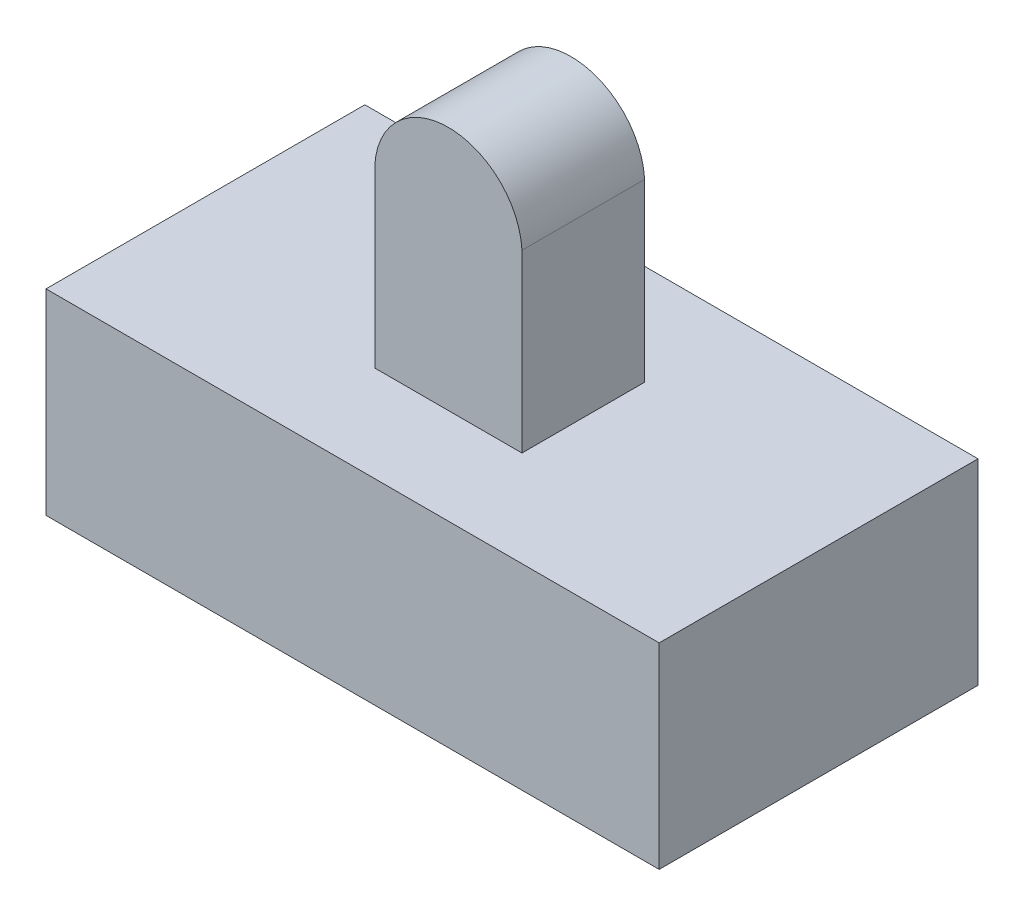
ISO-10303-21;
HEADER;
FILE_DESCRIPTION(('STEP AP214'),'2;1');
FILE_NAME('part.step','',(''),(''),'','','');
FILE_SCHEMA(('AUTOMOTIVE_DESIGN { 1 0 10303 214 1 1 1 1 }'));
ENDSEC;
DATA;
#1=APPLICATION_CONTEXT('core data for automotive mechanical design processes');
#2=APPLICATION_PROTOCOL_DEFINITION('international standard','automotive_design',2000,#1);
#3=PRODUCT_CONTEXT('',#1,'mechanical');
#4=PRODUCT('Part','Part','',(#3));
#5=PRODUCT_RELATED_PRODUCT_CATEGORY('part','',(#4));
#6=PRODUCT_DEFINITION_FORMATION('','',#4);
#7=PRODUCT_DEFINITION_CONTEXT('part definition',#1,'design');
#8=PRODUCT_DEFINITION('design','',#6,#7);
#9=PRODUCT_DEFINITION_SHAPE('','',#8);
#10=(LENGTH_UNIT() NAMED_UNIT(*) SI_UNIT(.MILLI.,.METRE.));
#11=(NAMED_UNIT(*) PLANE_ANGLE_UNIT() SI_UNIT($,.RADIAN.));
#12=(NAMED_UNIT(*) SI_UNIT($,.STERADIAN.) SOLID_ANGLE_UNIT());
#13=UNCERTAINTY_MEASURE_WITH_UNIT(LENGTH_MEASURE(1.E-05),#10,'distance_accuracy_value','');
#14=(GEOMETRIC_REPRESENTATION_CONTEXT(3) GLOBAL_UNCERTAINTY_ASSIGNED_CONTEXT((#13)) GLOBAL_UNIT_ASSIGNED_CONTEXT((#10,
#11,#12)) REPRESENTATION_CONTEXT('',''));
#15=CARTESIAN_POINT('',(0.,0.,0.));
#16=DIRECTION('',(0.,0.,1.));
#17=DIRECTION('',(1.,0.,0.));
#18=AXIS2_PLACEMENT_3D('',#15,#16,#17);
#19=CARTESIAN_POINT('',(9.67525773195877,18.,-0.59748188321778));
#20=DIRECTION('',(0.,0.,1.));
#21=DIRECTION('',(1.,0.,0.));
#22=AXIS2_PLACEMENT_3D('',#19,#20,#21);
#23=PLANE('',#22);
#24=CARTESIAN_POINT('',(6.67525773195877,14.9954138747722,-0.597481883217779));
#25=DIRECTION('',(0.,0.,-1.));
#26=DIRECTION('',(-1.,0.,0.));
#27=AXIS2_PLACEMENT_3D('',#24,#25,#26);
#28=CIRCLE('',#27,3.00458612522776);
#29=CARTESIAN_POINT('',(9.67525773195877,15.1613589979641,-0.59748188321778));
#30=VERTEX_POINT('',#29);
#31=CARTESIAN_POINT('',(3.67525773195877,15.1613589979641,-0.597481883217779));
#32=VERTEX_POINT('',#31);
#33=EDGE_CURVE('E147',#30,#32,#28,.F.);
#34=ORIENTED_EDGE('',*,*,#33,.F.);
#35=DIRECTION('',(0.,-1.,0.));
#36=VECTOR('',#35,1.);
#37=CARTESIAN_POINT('',(9.67525773195877,18.,-0.59748188321778));
#38=LINE('',#37,#36);
#39=CARTESIAN_POINT('',(9.67525773195877,8.,-0.59748188321778));
#40=VERTEX_POINT('',#39);
#41=EDGE_CURVE('E151',#30,#40,#38,.T.);
#42=ORIENTED_EDGE('',*,*,#41,.T.);
#43=DIRECTION('',(-1.,0.,0.));
#44=VECTOR('',#43,1.);
#45=CARTESIAN_POINT('',(9.67525773195877,8.,-0.59748188321778));
#46=LINE('',#45,#44);
#47=CARTESIAN_POINT('',(3.67525773195877,8.,-0.597481883217779));
#48=VERTEX_POINT('',#47);
#49=EDGE_CURVE('E397',#40,#48,#46,.T.);
#50=ORIENTED_EDGE('',*,*,#49,.T.);
#51=DIRECTION('',(0.,-1.,0.));
#52=VECTOR('',#51,1.);
#53=CARTESIAN_POINT('',(3.67525773195877,18.,-0.597481883217779));
#54=LINE('',#53,#52);
#55=EDGE_CURVE('E153',#32,#48,#54,.T.);
#56=ORIENTED_EDGE('',*,*,#55,.F.);
#57=EDGE_LOOP('',(#34,#42,#50,#56));
#58=FACE_BOUND('',#57,.T.);
#59=ADVANCED_FACE('F55',(#58),#23,.F.);
#60=CARTESIAN_POINT('',(9.67525773195877,18.,4.40251811678222));
#61=DIRECTION('',(0.,0.,-1.));
#62=DIRECTION('',(-1.,0.,0.));
#63=AXIS2_PLACEMENT_3D('',#60,#61,#62);
#64=PLANE('',#63);
#65=DIRECTION('',(0.,-1.,0.));
#66=VECTOR('',#65,1.);
#67=CARTESIAN_POINT('',(9.67525773195877,18.,4.40251811678222));
#68=LINE('',#67,#66);
#69=CARTESIAN_POINT('',(9.67525773195877,15.1613589979641,4.40251811678222));
#70=VERTEX_POINT('',#69);
#71=CARTESIAN_POINT('',(9.67525773195877,8.,4.40251811678222));
#72=VERTEX_POINT('',#71);
#73=EDGE_CURVE('E70',#70,#72,#68,.T.);
#74=ORIENTED_EDGE('',*,*,#73,.F.);
#75=CARTESIAN_POINT('',(6.67525773195877,14.9954138747722,4.40251811678222));
#76=DIRECTION('',(0.,0.,-1.));
#77=DIRECTION('',(-1.,0.,0.));
#78=AXIS2_PLACEMENT_3D('',#75,#76,#77);
#79=CIRCLE('',#78,3.00458612522776);
#80=CARTESIAN_POINT('',(3.67525773195877,15.1613589979641,4.40251811678222));
#81=VERTEX_POINT('',#80);
#82=EDGE_CURVE('E160',#70,#81,#79,.F.);
#83=ORIENTED_EDGE('',*,*,#82,.T.);
#84=DIRECTION('',(0.,-1.,0.));
#85=VECTOR('',#84,1.);
#86=CARTESIAN_POINT('',(3.67525773195877,18.,4.40251811678222));
#87=LINE('',#86,#85);
#88=CARTESIAN_POINT('',(3.67525773195877,8.,4.40251811678222));
#89=VERTEX_POINT('',#88);
#90=EDGE_CURVE('E78',#81,#89,#87,.T.);
#91=ORIENTED_EDGE('',*,*,#90,.T.);
#92=DIRECTION('',(1.,0.,0.));
#93=VECTOR('',#92,1.);
#94=CARTESIAN_POINT('',(9.67525773195877,8.,4.40251811678222));
#95=LINE('',#94,#93);
#96=EDGE_CURVE('E392',#89,#72,#95,.T.);
#97=ORIENTED_EDGE('',*,*,#96,.T.);
#98=EDGE_LOOP('',(#74,#83,#91,#97));
#99=FACE_BOUND('',#98,.T.);
#100=ADVANCED_FACE('F251',(#99),#64,.F.);
#101=CARTESIAN_POINT('',(-5.82474226804123,8.,-4.69072164948454));
#102=DIRECTION('',(1.,0.,0.));
#103=DIRECTION('',(0.,0.,-1.));
#104=AXIS2_PLACEMENT_3D('',#101,#102,#103);
#105=PLANE('',#104);
#106=DIRECTION('',(0.,0.,1.));
#107=VECTOR('',#106,1.);
#108=CARTESIAN_POINT('',(-5.82474226804123,0.,-4.69072164948454));
#109=LINE('',#108,#107);
#110=CARTESIAN_POINT('',(-5.82474226804123,0.,-4.69072164948454));
#111=VERTEX_POINT('',#110);
#112=CARTESIAN_POINT('',(-5.82474226804123,0.,8.30927835051546));
#113=VERTEX_POINT('',#112);
#114=EDGE_CURVE('E194',#111,#113,#109,.T.);
#115=ORIENTED_EDGE('',*,*,#114,.T.);
#116=DIRECTION('',(0.,-1.,0.));
#117=VECTOR('',#116,1.);
#118=CARTESIAN_POINT('',(-5.82474226804123,8.,8.30927835051546));
#119=LINE('',#118,#117);
#120=CARTESIAN_POINT('',(-5.82474226804123,8.,8.30927835051546));
#121=VERTEX_POINT('',#120);
#122=EDGE_CURVE('E12',#121,#113,#119,.T.);
#123=ORIENTED_EDGE('',*,*,#122,.F.);
#124=DIRECTION('',(0.,0.,1.));
#125=VECTOR('',#124,1.);
#126=CARTESIAN_POINT('',(-5.82474226804123,8.,-4.69072164948454));
#127=LINE('',#126,#125);
#128=CARTESIAN_POINT('',(-5.82474226804123,8.,-4.69072164948454));
#129=VERTEX_POINT('',#128);
#130=EDGE_CURVE('E201',#129,#121,#127,.T.);
#131=ORIENTED_EDGE('',*,*,#130,.F.);
#132=DIRECTION('',(0.,-1.,0.));
#133=VECTOR('',#132,1.);
#134=CARTESIAN_POINT('',(-5.82474226804123,8.,-4.69072164948454));
#135=LINE('',#134,#133);
#136=EDGE_CURVE('E211',#129,#111,#135,.T.);
#137=ORIENTED_EDGE('',*,*,#136,.T.);
#138=EDGE_LOOP('',(#115,#123,#131,#137));
#139=FACE_BOUND('',#138,.T.);
#140=ADVANCED_FACE('F57',(#139),#105,.F.);
#141=CARTESIAN_POINT('',(-5.82474226804123,8.,8.30927835051546));
#142=DIRECTION('',(0.,0.,-1.));
#143=DIRECTION('',(-1.,0.,0.));
#144=AXIS2_PLACEMENT_3D('',#141,#142,#143);
#145=PLANE('',#144);
#146=DIRECTION('',(1.,0.,0.));
#147=VECTOR('',#146,1.);
#148=CARTESIAN_POINT('',(-5.82474226804123,0.,8.30927835051546));
#149=LINE('',#148,#147);
#150=CARTESIAN_POINT('',(19.1752577319588,0.,8.30927835051546));
#151=VERTEX_POINT('',#150);
#152=EDGE_CURVE('E214',#113,#151,#149,.T.);
#153=ORIENTED_EDGE('',*,*,#152,.T.);
#154=DIRECTION('',(0.,-1.,0.));
#155=VECTOR('',#154,1.);
#156=CARTESIAN_POINT('',(19.1752577319588,8.,8.30927835051546));
#157=LINE('',#156,#155);
#158=CARTESIAN_POINT('',(19.1752577319588,8.,8.30927835051546));
#159=VERTEX_POINT('',#158);
#160=EDGE_CURVE('E63',#159,#151,#157,.T.);
#161=ORIENTED_EDGE('',*,*,#160,.F.);
#162=DIRECTION('',(1.,0.,0.));
#163=VECTOR('',#162,1.);
#164=CARTESIAN_POINT('',(-5.82474226804123,8.,8.30927835051546));
#165=LINE('',#164,#163);
#166=EDGE_CURVE('E204',#121,#159,#165,.T.);
#167=ORIENTED_EDGE('',*,*,#166,.F.);
#168=ORIENTED_EDGE('',*,*,#122,.T.);
#169=EDGE_LOOP('',(#153,#161,#167,#168));
#170=FACE_BOUND('',#169,.T.);
#171=ADVANCED_FACE('F244',(#170),#145,.F.);
#172=CARTESIAN_POINT('',(19.1752577319588,8.,-4.69072164948454));
#173=DIRECTION('',(-1.,0.,0.));
#174=DIRECTION('',(0.,0.,1.));
#175=AXIS2_PLACEMENT_3D('',#172,#173,#174);
#176=PLANE('',#175);
#177=DIRECTION('',(0.,0.,-1.));
#178=VECTOR('',#177,1.);
#179=CARTESIAN_POINT('',(19.1752577319588,0.,-4.69072164948454));
#180=LINE('',#179,#178);
#181=CARTESIAN_POINT('',(19.1752577319588,0.,-4.69072164948454));
#182=VERTEX_POINT('',#181);
#183=EDGE_CURVE('E216',#151,#182,#180,.T.);
#184=ORIENTED_EDGE('',*,*,#183,.T.);
#185=DIRECTION('',(0.,-1.,0.));
#186=VECTOR('',#185,1.);
#187=CARTESIAN_POINT('',(19.1752577319588,8.,-4.69072164948454));
#188=LINE('',#187,#186);
#189=CARTESIAN_POINT('',(19.1752577319588,8.,-4.69072164948454));
#190=VERTEX_POINT('',#189);
#191=EDGE_CURVE('E221',#190,#182,#188,.T.);
#192=ORIENTED_EDGE('',*,*,#191,.F.);
#193=DIRECTION('',(0.,0.,-1.));
#194=VECTOR('',#193,1.);
#195=CARTESIAN_POINT('',(19.1752577319588,8.,-4.69072164948454));
#196=LINE('',#195,#194);
#197=EDGE_CURVE('E207',#159,#190,#196,.T.);
#198=ORIENTED_EDGE('',*,*,#197,.F.);
#199=ORIENTED_EDGE('',*,*,#160,.T.);
#200=EDGE_LOOP('',(#184,#192,#198,#199));
#201=FACE_BOUND('',#200,.T.);
#202=ADVANCED_FACE('F228',(#201),#176,.F.);
#203=CARTESIAN_POINT('',(-5.82474226804123,8.,-4.69072164948454));
#204=DIRECTION('',(0.,0.,1.));
#205=DIRECTION('',(1.,0.,0.));
#206=AXIS2_PLACEMENT_3D('',#203,#204,#205);
#207=PLANE('',#206);
#208=DIRECTION('',(-1.,0.,0.));
#209=VECTOR('',#208,1.);
#210=CARTESIAN_POINT('',(-5.82474226804123,0.,-4.69072164948454));
#211=LINE('',#210,#209);
#212=EDGE_CURVE('E205',#182,#111,#211,.T.);
#213=ORIENTED_EDGE('',*,*,#212,.T.);
#214=ORIENTED_EDGE('',*,*,#136,.F.);
#215=DIRECTION('',(-1.,0.,0.));
#216=VECTOR('',#215,1.);
#217=CARTESIAN_POINT('',(-5.82474226804123,8.,-4.69072164948454));
#218=LINE('',#217,#216);
#219=EDGE_CURVE('E209',#190,#129,#218,.T.);
#220=ORIENTED_EDGE('',*,*,#219,.F.);
#221=ORIENTED_EDGE('',*,*,#191,.T.);
#222=EDGE_LOOP('',(#213,#214,#220,#221));
#223=FACE_BOUND('',#222,.T.);
#224=ADVANCED_FACE('F237',(#223),#207,.F.);
#225=CARTESIAN_POINT('',(0.,8.,0.));
#226=DIRECTION('',(0.,1.,0.));
#227=DIRECTION('',(0.,0.,1.));
#228=AXIS2_PLACEMENT_3D('',#225,#226,#227);
#229=PLANE('',#228);
#230=DIRECTION('',(0.,0.,-1.));
#231=VECTOR('',#230,1.);
#232=CARTESIAN_POINT('',(9.67525773195877,8.,-0.59748188321778));
#233=LINE('',#232,#231);
#234=EDGE_CURVE('E163',#72,#40,#233,.T.);
#235=ORIENTED_EDGE('',*,*,#234,.F.);
#236=ORIENTED_EDGE('',*,*,#96,.F.);
#237=DIRECTION('',(0.,0.,1.));
#238=VECTOR('',#237,1.);
#239=CARTESIAN_POINT('',(3.67525773195877,8.,-0.597481883217779));
#240=LINE('',#239,#238);
#241=EDGE_CURVE('E391',#48,#89,#240,.T.);
#242=ORIENTED_EDGE('',*,*,#241,.F.);
#243=ORIENTED_EDGE('',*,*,#49,.F.);
#244=EDGE_LOOP('',(#235,#236,#242,#243));
#245=FACE_BOUND('',#244,.T.);
#246=ORIENTED_EDGE('',*,*,#130,.T.);
#247=ORIENTED_EDGE('',*,*,#166,.T.);
#248=ORIENTED_EDGE('',*,*,#197,.T.);
#249=ORIENTED_EDGE('',*,*,#219,.T.);
#250=EDGE_LOOP('',(#246,#247,#248,#249));
#251=FACE_BOUND('',#250,.T.);
#252=ADVANCED_FACE('F243',(#245,#251),#229,.T.);
#253=CARTESIAN_POINT('',(0.,0.,0.));
#254=DIRECTION('',(0.,1.,0.));
#255=DIRECTION('',(0.,0.,1.));
#256=AXIS2_PLACEMENT_3D('',#253,#254,#255);
#257=PLANE('',#256);
#258=DIRECTION('',(-1.,0.,0.));
#259=VECTOR('',#258,1.);
#260=CARTESIAN_POINT('',(9.36738967892104,0.,3.39414754531842));
#261=LINE('',#260,#259);
#262=CARTESIAN_POINT('',(9.36738967892104,0.,3.39414754531842));
#263=VERTEX_POINT('',#262);
#264=CARTESIAN_POINT('',(3.36738967892103,0.,3.39414754531842));
#265=VERTEX_POINT('',#264);
#266=EDGE_CURVE('E166',#263,#265,#261,.T.);
#267=ORIENTED_EDGE('',*,*,#266,.F.);
#268=DIRECTION('',(0.,0.,1.));
#269=VECTOR('',#268,1.);
#270=CARTESIAN_POINT('',(9.36738967892104,0.,3.39414754531842));
#271=LINE('',#270,#269);
#272=CARTESIAN_POINT('',(9.36738967892104,0.,0.294147545318425));
#273=VERTEX_POINT('',#272);
#274=EDGE_CURVE('E164',#273,#263,#271,.T.);
#275=ORIENTED_EDGE('',*,*,#274,.F.);
#276=DIRECTION('',(1.,0.,0.));
#277=VECTOR('',#276,1.);
#278=CARTESIAN_POINT('',(9.36738967892104,0.,0.294147545318425));
#279=LINE('',#278,#277);
#280=CARTESIAN_POINT('',(3.36738967892103,0.,0.294147545318424));
#281=VERTEX_POINT('',#280);
#282=EDGE_CURVE('E175',#281,#273,#279,.T.);
#283=ORIENTED_EDGE('',*,*,#282,.F.);
#284=DIRECTION('',(0.,0.,-1.));
#285=VECTOR('',#284,1.);
#286=CARTESIAN_POINT('',(3.36738967892103,0.,3.39414754531842));
#287=LINE('',#286,#285);
#288=EDGE_CURVE('E187',#265,#281,#287,.T.);
#289=ORIENTED_EDGE('',*,*,#288,.F.);
#290=EDGE_LOOP('',(#267,#275,#283,#289));
#291=FACE_BOUND('',#290,.T.);
#292=ORIENTED_EDGE('',*,*,#114,.F.);
#293=ORIENTED_EDGE('',*,*,#212,.F.);
#294=ORIENTED_EDGE('',*,*,#183,.F.);
#295=ORIENTED_EDGE('',*,*,#152,.F.);
#296=EDGE_LOOP('',(#292,#293,#294,#295));
#297=FACE_BOUND('',#296,.T.);
#298=ADVANCED_FACE('F234',(#291,#297),#257,.F.);
#299=CARTESIAN_POINT('',(9.36738967892104,5.,3.39414754531842));
#300=DIRECTION('',(1.,0.,0.));
#301=DIRECTION('',(0.,0.,-1.));
#302=AXIS2_PLACEMENT_3D('',#299,#300,#301);
#303=PLANE('',#302);
#304=ORIENTED_EDGE('',*,*,#274,.T.);
#305=DIRECTION('',(0.,-1.,0.));
#306=VECTOR('',#305,1.);
#307=CARTESIAN_POINT('',(9.36738967892104,5.,3.39414754531842));
#308=LINE('',#307,#306);
#309=CARTESIAN_POINT('',(9.36738967892104,5.,3.39414754531842));
#310=VERTEX_POINT('',#309);
#311=EDGE_CURVE('E183',#310,#263,#308,.T.);
#312=ORIENTED_EDGE('',*,*,#311,.F.);
#313=DIRECTION('',(0.,0.,1.));
#314=VECTOR('',#313,1.);
#315=CARTESIAN_POINT('',(9.36738967892104,5.,3.39414754531842));
#316=LINE('',#315,#314);
#317=CARTESIAN_POINT('',(9.36738967892104,5.,0.294147545318425));
#318=VERTEX_POINT('',#317);
#319=EDGE_CURVE('E171',#318,#310,#316,.T.);
#320=ORIENTED_EDGE('',*,*,#319,.F.);
#321=DIRECTION('',(0.,-1.,0.));
#322=VECTOR('',#321,1.);
#323=CARTESIAN_POINT('',(9.36738967892104,5.,0.294147545318425));
#324=LINE('',#323,#322);
#325=EDGE_CURVE('E192',#318,#273,#324,.T.);
#326=ORIENTED_EDGE('',*,*,#325,.T.);
#327=EDGE_LOOP('',(#304,#312,#320,#326));
#328=FACE_BOUND('',#327,.T.);
#329=ADVANCED_FACE('F272',(#328),#303,.F.);
#330=CARTESIAN_POINT('',(9.36738967892104,5.,0.294147545318425));
#331=DIRECTION('',(0.,0.,-1.));
#332=DIRECTION('',(-1.,0.,0.));
#333=AXIS2_PLACEMENT_3D('',#330,#331,#332);
#334=PLANE('',#333);
#335=ORIENTED_EDGE('',*,*,#282,.T.);
#336=ORIENTED_EDGE('',*,*,#325,.F.);
#337=DIRECTION('',(1.,0.,0.));
#338=VECTOR('',#337,1.);
#339=CARTESIAN_POINT('',(9.36738967892104,5.,0.294147545318425));
#340=LINE('',#339,#338);
#341=CARTESIAN_POINT('',(3.36738967892103,5.,0.294147545318424));
#342=VERTEX_POINT('',#341);
#343=EDGE_CURVE('E181',#342,#318,#340,.T.);
#344=ORIENTED_EDGE('',*,*,#343,.F.);
#345=DIRECTION('',(0.,-1.,0.));
#346=VECTOR('',#345,1.);
#347=CARTESIAN_POINT('',(3.36738967892103,5.,0.294147545318424));
#348=LINE('',#347,#346);
#349=EDGE_CURVE('E195',#342,#281,#348,.T.);
#350=ORIENTED_EDGE('',*,*,#349,.T.);
#351=EDGE_LOOP('',(#335,#336,#344,#350));
#352=FACE_BOUND('',#351,.T.);
#353=ADVANCED_FACE('F268',(#352),#334,.F.);
#354=CARTESIAN_POINT('',(3.36738967892103,5.,3.39414754531842));
#355=DIRECTION('',(-1.,0.,0.));
#356=DIRECTION('',(0.,0.,1.));
#357=AXIS2_PLACEMENT_3D('',#354,#355,#356);
#358=PLANE('',#357);
#359=ORIENTED_EDGE('',*,*,#288,.T.);
#360=ORIENTED_EDGE('',*,*,#349,.F.);
#361=DIRECTION('',(0.,0.,-1.));
#362=VECTOR('',#361,1.);
#363=CARTESIAN_POINT('',(3.36738967892103,5.,3.39414754531842));
#364=LINE('',#363,#362);
#365=CARTESIAN_POINT('',(3.36738967892103,5.,3.39414754531842));
#366=VERTEX_POINT('',#365);
#367=EDGE_CURVE('E178',#366,#342,#364,.T.);
#368=ORIENTED_EDGE('',*,*,#367,.F.);
#369=DIRECTION('',(0.,-1.,0.));
#370=VECTOR('',#369,1.);
#371=CARTESIAN_POINT('',(3.36738967892103,5.,3.39414754531842));
#372=LINE('',#371,#370);
#373=EDGE_CURVE('E197',#366,#265,#372,.T.);
#374=ORIENTED_EDGE('',*,*,#373,.T.);
#375=EDGE_LOOP('',(#359,#360,#368,#374));
#376=FACE_BOUND('',#375,.T.);
#377=ADVANCED_FACE('F271',(#376),#358,.F.);
#378=CARTESIAN_POINT('',(9.36738967892104,5.,3.39414754531842));
#379=DIRECTION('',(0.,0.,1.));
#380=DIRECTION('',(1.,0.,0.));
#381=AXIS2_PLACEMENT_3D('',#378,#379,#380);
#382=PLANE('',#381);
#383=ORIENTED_EDGE('',*,*,#266,.T.);
#384=ORIENTED_EDGE('',*,*,#373,.F.);
#385=DIRECTION('',(-1.,0.,0.));
#386=VECTOR('',#385,1.);
#387=CARTESIAN_POINT('',(9.36738967892104,5.,3.39414754531842));
#388=LINE('',#387,#386);
#389=EDGE_CURVE('E174',#310,#366,#388,.T.);
#390=ORIENTED_EDGE('',*,*,#389,.F.);
#391=ORIENTED_EDGE('',*,*,#311,.T.);
#392=EDGE_LOOP('',(#383,#384,#390,#391));
#393=FACE_BOUND('',#392,.T.);
#394=ADVANCED_FACE('F266',(#393),#382,.F.);
#395=CARTESIAN_POINT('',(0.,5.,0.));
#396=DIRECTION('',(0.,1.,0.));
#397=DIRECTION('',(0.,0.,1.));
#398=AXIS2_PLACEMENT_3D('',#395,#396,#397);
#399=PLANE('',#398);
#400=ORIENTED_EDGE('',*,*,#319,.T.);
#401=ORIENTED_EDGE('',*,*,#389,.T.);
#402=ORIENTED_EDGE('',*,*,#367,.T.);
#403=ORIENTED_EDGE('',*,*,#343,.T.);
#404=EDGE_LOOP('',(#400,#401,#402,#403));
#405=FACE_BOUND('',#404,.T.);
#406=ADVANCED_FACE('F263',(#405),#399,.F.);
#407=CARTESIAN_POINT('',(9.67525773195877,18.,-0.59748188321778));
#408=DIRECTION('',(-1.,0.,0.));
#409=DIRECTION('',(0.,0.,1.));
#410=AXIS2_PLACEMENT_3D('',#407,#408,#409);
#411=PLANE('',#410);
#412=ORIENTED_EDGE('',*,*,#41,.F.);
#413=DIRECTION('',(0.,0.,-1.));
#414=VECTOR('',#413,1.);
#415=CARTESIAN_POINT('',(9.67525773195877,15.1613589979641,9.40251811678222));
#416=LINE('',#415,#414);
#417=EDGE_CURVE('E157',#70,#30,#416,.T.);
#418=ORIENTED_EDGE('',*,*,#417,.F.);
#419=ORIENTED_EDGE('',*,*,#73,.T.);
#420=ORIENTED_EDGE('',*,*,#234,.T.);
#421=EDGE_LOOP('',(#412,#418,#419,#420));
#422=FACE_BOUND('',#421,.T.);
#423=ADVANCED_FACE('F162',(#422),#411,.F.);
#424=CARTESIAN_POINT('',(3.67525773195877,18.,-0.597481883217779));
#425=DIRECTION('',(1.,0.,0.));
#426=DIRECTION('',(0.,0.,-1.));
#427=AXIS2_PLACEMENT_3D('',#424,#425,#426);
#428=PLANE('',#427);
#429=ORIENTED_EDGE('',*,*,#90,.F.);
#430=DIRECTION('',(0.,0.,-1.));
#431=VECTOR('',#430,1.);
#432=CARTESIAN_POINT('',(3.67525773195877,15.1613589979641,9.40251811678222));
#433=LINE('',#432,#431);
#434=EDGE_CURVE('E156',#81,#32,#433,.T.);
#435=ORIENTED_EDGE('',*,*,#434,.T.);
#436=ORIENTED_EDGE('',*,*,#55,.T.);
#437=ORIENTED_EDGE('',*,*,#241,.T.);
#438=EDGE_LOOP('',(#429,#435,#436,#437));
#439=FACE_BOUND('',#438,.T.);
#440=ADVANCED_FACE('F260',(#439),#428,.F.);
#441=CARTESIAN_POINT('',(6.67525773195877,14.9954138747722,9.40251811678222));
#442=DIRECTION('',(0.,0.,-1.));
#443=DIRECTION('',(-1.,0.,0.));
#444=AXIS2_PLACEMENT_3D('',#441,#442,#443);
#445=CYLINDRICAL_SURFACE('',#444,3.00458612522776);
#446=ORIENTED_EDGE('',*,*,#82,.F.);
#447=ORIENTED_EDGE('',*,*,#417,.T.);
#448=ORIENTED_EDGE('',*,*,#33,.T.);
#449=ORIENTED_EDGE('',*,*,#434,.F.);
#450=EDGE_LOOP('',(#446,#447,#448,#449));
#451=FACE_BOUND('',#450,.T.);
#452=ADVANCED_FACE('F159',(#451),#445,.T.);
#453=CLOSED_SHELL('',(#59,#100,#140,#171,#202,#224,#252,#298,#329,#353,#377,#394,#406,#423,#440,#452));
#454=MANIFOLD_SOLID_BREP('B2',#453);
#455=ADVANCED_BREP_SHAPE_REPRESENTATION('',(#18,#454),#14);
#456=SHAPE_DEFINITION_REPRESENTATION(#9,#455);
ENDSEC;
END-ISO-10303-21;
